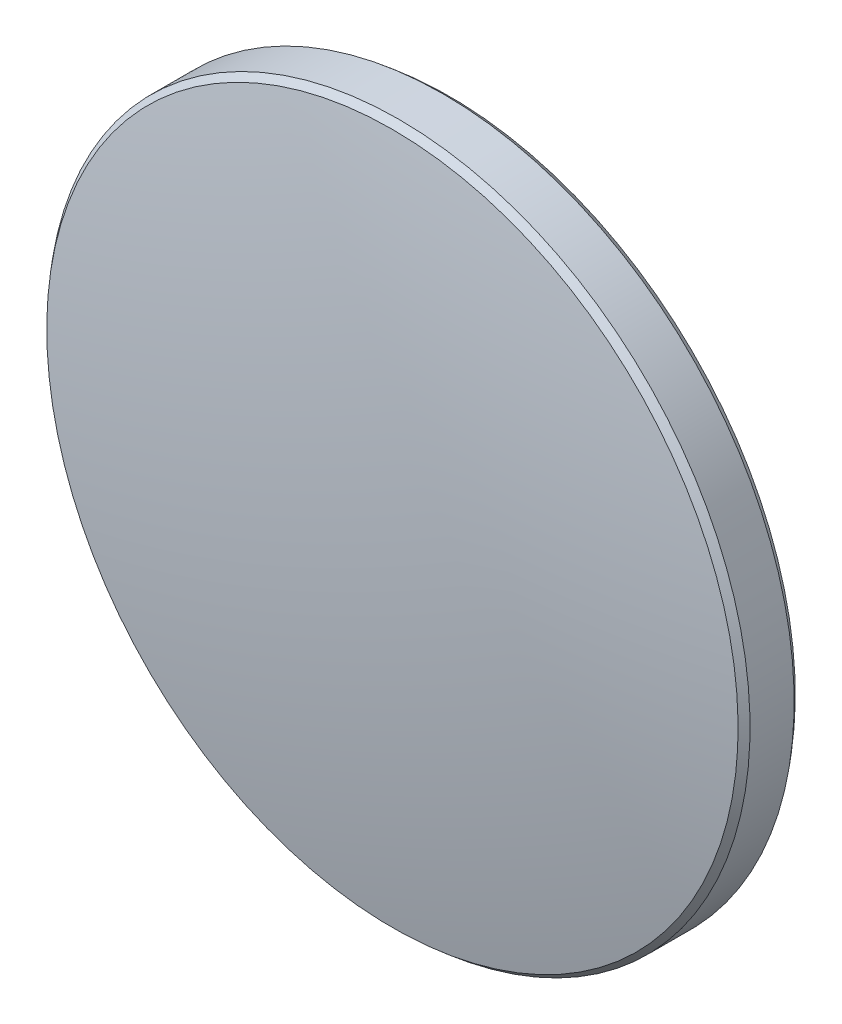
ISO-10303-21;
HEADER;
FILE_DESCRIPTION(('STEP AP214'),'2;1');
FILE_NAME('part.step','',(''),(''),'','','');
FILE_SCHEMA(('AUTOMOTIVE_DESIGN { 1 0 10303 214 1 1 1 1 }'));
ENDSEC;
DATA;
#1=APPLICATION_CONTEXT('core data for automotive mechanical design processes');
#2=APPLICATION_PROTOCOL_DEFINITION('international standard','automotive_design',2000,#1);
#3=PRODUCT_CONTEXT('',#1,'mechanical');
#4=PRODUCT('Part','Part','',(#3));
#5=PRODUCT_RELATED_PRODUCT_CATEGORY('part','',(#4));
#6=PRODUCT_DEFINITION_FORMATION('','',#4);
#7=PRODUCT_DEFINITION_CONTEXT('part definition',#1,'design');
#8=PRODUCT_DEFINITION('design','',#6,#7);
#9=PRODUCT_DEFINITION_SHAPE('','',#8);
#10=(LENGTH_UNIT() NAMED_UNIT(*) SI_UNIT(.MILLI.,.METRE.));
#11=(NAMED_UNIT(*) PLANE_ANGLE_UNIT() SI_UNIT($,.RADIAN.));
#12=(NAMED_UNIT(*) SI_UNIT($,.STERADIAN.) SOLID_ANGLE_UNIT());
#13=UNCERTAINTY_MEASURE_WITH_UNIT(LENGTH_MEASURE(1.E-05),#10,'distance_accuracy_value','');
#14=(GEOMETRIC_REPRESENTATION_CONTEXT(3) GLOBAL_UNCERTAINTY_ASSIGNED_CONTEXT((#13)) GLOBAL_UNIT_ASSIGNED_CONTEXT((#10,
#11,#12)) REPRESENTATION_CONTEXT('',''));
#15=CARTESIAN_POINT('',(0.,0.,0.));
#16=DIRECTION('',(0.,0.,1.));
#17=DIRECTION('',(1.,0.,0.));
#18=AXIS2_PLACEMENT_3D('',#15,#16,#17);
#19=CARTESIAN_POINT('',(0.,0.,-67.81));
#20=DIRECTION('',(0.,0.,1.));
#21=DIRECTION('',(0.,1.,0.));
#22=AXIS2_PLACEMENT_3D('',#19,#20,#21);
#23=SPHERICAL_SURFACE('',#22,69.97);
#24=CARTESIAN_POINT('',(0.,0.,1.03374128667018));
#25=DIRECTION('',(0.,0.,-1.));
#26=DIRECTION('',(0.,1.,0.));
#27=AXIS2_PLACEMENT_3D('',#24,#25,#26);
#28=CIRCLE('',#27,12.5036069057702);
#29=CARTESIAN_POINT('',(0.,12.5036069057702,1.03374128667018));
#30=VERTEX_POINT('',#29);
#31=EDGE_CURVE('E9',#30,#30,#28,.F.);
#32=ORIENTED_EDGE('',*,*,#31,.T.);
#33=EDGE_LOOP('',(#32));
#34=FACE_BOUND('',#33,.T.);
#35=ADVANCED_FACE('F13',(#34),#23,.T.);
#36=CARTESIAN_POINT('',(0.,0.,2.16));
#37=DIRECTION('',(0.,0.,1.));
#38=DIRECTION('',(0.,-1.,0.));
#39=AXIS2_PLACEMENT_3D('',#36,#37,#38);
#40=CYLINDRICAL_SURFACE('',#39,12.7);
#41=CARTESIAN_POINT('',(0.,0.,-0.797782263345745));
#42=DIRECTION('',(0.,0.,1.));
#43=DIRECTION('',(0.,-1.,0.));
#44=AXIS2_PLACEMENT_3D('',#41,#42,#43);
#45=CIRCLE('',#44,12.7);
#46=CARTESIAN_POINT('',(0.,-12.7,-0.797782263345747));
#47=VERTEX_POINT('',#46);
#48=EDGE_CURVE('E24',#47,#47,#45,.T.);
#49=ORIENTED_EDGE('',*,*,#48,.T.);
#50=EDGE_LOOP('',(#49));
#51=FACE_BOUND('',#50,.T.);
#52=CARTESIAN_POINT('',(0.,0.,0.797782263345745));
#53=DIRECTION('',(0.,0.,-1.));
#54=DIRECTION('',(0.,1.,0.));
#55=AXIS2_PLACEMENT_3D('',#52,#53,#54);
#56=CIRCLE('',#55,12.7);
#57=CARTESIAN_POINT('',(0.,12.7,0.797782263345747));
#58=VERTEX_POINT('',#57);
#59=EDGE_CURVE('E28',#58,#58,#56,.T.);
#60=ORIENTED_EDGE('',*,*,#59,.T.);
#61=EDGE_LOOP('',(#60));
#62=FACE_BOUND('',#61,.T.);
#63=ADVANCED_FACE('F34',(#51,#62),#40,.T.);
#64=CARTESIAN_POINT('',(0.,0.,67.81));
#65=DIRECTION('',(0.,0.,1.));
#66=DIRECTION('',(0.,-1.,0.));
#67=AXIS2_PLACEMENT_3D('',#64,#65,#66);
#68=SPHERICAL_SURFACE('',#67,69.97);
#69=CARTESIAN_POINT('',(0.,0.,-1.03374128667016));
#70=DIRECTION('',(0.,0.,1.));
#71=DIRECTION('',(0.,-1.,0.));
#72=AXIS2_PLACEMENT_3D('',#69,#70,#71);
#73=CIRCLE('',#72,12.5036069057702);
#74=CARTESIAN_POINT('',(0.,-12.5036069057702,-1.03374128667017));
#75=VERTEX_POINT('',#74);
#76=EDGE_CURVE('E20',#75,#75,#73,.F.);
#77=ORIENTED_EDGE('',*,*,#76,.T.);
#78=EDGE_LOOP('',(#77));
#79=FACE_BOUND('',#78,.T.);
#80=ADVANCED_FACE('F43',(#79),#68,.T.);
#81=CARTESIAN_POINT('',(0.,0.,-0.797782263345745));
#82=DIRECTION('',(0.,0.,1.));
#83=DIRECTION('',(0.,-1.,0.));
#84=AXIS2_PLACEMENT_3D('',#81,#82,#83);
#85=CONICAL_SURFACE('',#84,12.7,0.694139143977552);
#86=ORIENTED_EDGE('',*,*,#76,.F.);
#87=EDGE_LOOP('',(#86));
#88=FACE_BOUND('',#87,.T.);
#89=ORIENTED_EDGE('',*,*,#48,.F.);
#90=EDGE_LOOP('',(#89));
#91=FACE_BOUND('',#90,.T.);
#92=ADVANCED_FACE('F38',(#88,#91),#85,.T.);
#93=CARTESIAN_POINT('',(0.,0.,1.03374128667018));
#94=DIRECTION('',(0.,0.,-1.));
#95=DIRECTION('',(0.,1.,0.));
#96=AXIS2_PLACEMENT_3D('',#93,#94,#95);
#97=CONICAL_SURFACE('',#96,12.5036069057702,0.694139143977592);
#98=ORIENTED_EDGE('',*,*,#59,.F.);
#99=EDGE_LOOP('',(#98));
#100=FACE_BOUND('',#99,.T.);
#101=ORIENTED_EDGE('',*,*,#31,.F.);
#102=EDGE_LOOP('',(#101));
#103=FACE_BOUND('',#102,.T.);
#104=ADVANCED_FACE('F15',(#100,#103),#97,.T.);
#105=CLOSED_SHELL('',(#35,#63,#80,#92,#104));
#106=MANIFOLD_SOLID_BREP('B1',#105);
#107=ADVANCED_BREP_SHAPE_REPRESENTATION('',(#18,#106),#14);
#108=SHAPE_DEFINITION_REPRESENTATION(#9,#107);
ENDSEC;
END-ISO-10303-21;
